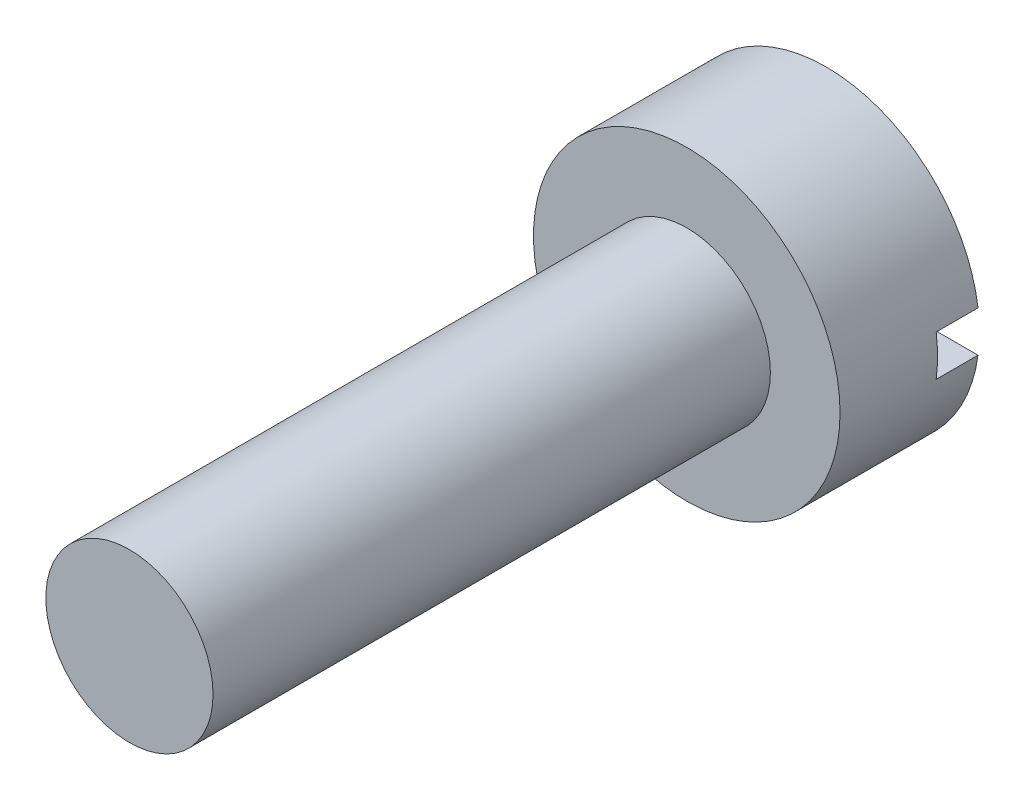
ISO-10303-21;
HEADER;
FILE_DESCRIPTION(('STEP AP214'),'2;1');
FILE_NAME('part.step','',(''),(''),'','','');
FILE_SCHEMA(('AUTOMOTIVE_DESIGN { 1 0 10303 214 1 1 1 1 }'));
ENDSEC;
DATA;
#1=APPLICATION_CONTEXT('core data for automotive mechanical design processes');
#2=APPLICATION_PROTOCOL_DEFINITION('international standard','automotive_design',2000,#1);
#3=PRODUCT_CONTEXT('',#1,'mechanical');
#4=PRODUCT('Part','Part','',(#3));
#5=PRODUCT_RELATED_PRODUCT_CATEGORY('part','',(#4));
#6=PRODUCT_DEFINITION_FORMATION('','',#4);
#7=PRODUCT_DEFINITION_CONTEXT('part definition',#1,'design');
#8=PRODUCT_DEFINITION('design','',#6,#7);
#9=PRODUCT_DEFINITION_SHAPE('','',#8);
#10=(LENGTH_UNIT() NAMED_UNIT(*) SI_UNIT(.MILLI.,.METRE.));
#11=(NAMED_UNIT(*) PLANE_ANGLE_UNIT() SI_UNIT($,.RADIAN.));
#12=(NAMED_UNIT(*) SI_UNIT($,.STERADIAN.) SOLID_ANGLE_UNIT());
#13=UNCERTAINTY_MEASURE_WITH_UNIT(LENGTH_MEASURE(1.E-05),#10,'distance_accuracy_value','');
#14=(GEOMETRIC_REPRESENTATION_CONTEXT(3) GLOBAL_UNCERTAINTY_ASSIGNED_CONTEXT((#13)) GLOBAL_UNIT_ASSIGNED_CONTEXT((#10,
#11,#12)) REPRESENTATION_CONTEXT('',''));
#15=CARTESIAN_POINT('',(0.,0.,0.));
#16=DIRECTION('',(0.,0.,1.));
#17=DIRECTION('',(1.,0.,0.));
#18=AXIS2_PLACEMENT_3D('',#15,#16,#17);
#19=CARTESIAN_POINT('',(0.,0.,0.));
#20=DIRECTION('',(0.,0.,1.));
#21=DIRECTION('',(1.,0.,0.));
#22=AXIS2_PLACEMENT_3D('',#19,#20,#21);
#23=PLANE('',#22);
#24=CARTESIAN_POINT('',(0.,0.,0.));
#25=DIRECTION('',(0.,0.,1.));
#26=DIRECTION('',(1.,0.,0.));
#27=AXIS2_PLACEMENT_3D('',#24,#25,#26);
#28=CIRCLE('',#27,2.75);
#29=CARTESIAN_POINT('',(-2.72533109306739,-0.367519296309898,0.));
#30=VERTEX_POINT('',#29);
#31=CARTESIAN_POINT('',(2.72533109306739,-0.367519296309898,0.));
#32=VERTEX_POINT('',#31);
#33=EDGE_CURVE('E91',#30,#32,#28,.T.);
#34=ORIENTED_EDGE('',*,*,#33,.F.);
#35=DIRECTION('',(1.,0.,0.));
#36=VECTOR('',#35,1.);
#37=CARTESIAN_POINT('',(0.,-0.367519296309898,0.));
#38=LINE('',#37,#36);
#39=EDGE_CURVE('E80',#30,#32,#38,.T.);
#40=ORIENTED_EDGE('',*,*,#39,.T.);
#41=EDGE_LOOP('',(#34,#40));
#42=FACE_BOUND('',#41,.T.);
#43=ADVANCED_FACE('F32',(#42),#23,.F.);
#44=CARTESIAN_POINT('',(0.,0.,2.5));
#45=DIRECTION('',(0.,0.,-1.));
#46=DIRECTION('',(-1.,0.,0.));
#47=AXIS2_PLACEMENT_3D('',#44,#45,#46);
#48=CYLINDRICAL_SURFACE('',#47,2.75);
#49=CARTESIAN_POINT('',(0.,0.,0.75));
#50=DIRECTION('',(0.,0.,1.));
#51=DIRECTION('',(1.,0.,0.));
#52=AXIS2_PLACEMENT_3D('',#49,#50,#51);
#53=CIRCLE('',#52,2.75);
#54=CARTESIAN_POINT('',(-2.72533109306739,0.367519296309898,0.75));
#55=VERTEX_POINT('',#54);
#56=CARTESIAN_POINT('',(-2.72533109306739,-0.367519296309898,0.75));
#57=VERTEX_POINT('',#56);
#58=EDGE_CURVE('E11',#55,#57,#53,.T.);
#59=ORIENTED_EDGE('',*,*,#58,.T.);
#60=DIRECTION('',(0.,0.,-1.));
#61=VECTOR('',#60,1.);
#62=CARTESIAN_POINT('',(-2.72533109306739,-0.367519296309898,2.5));
#63=LINE('',#62,#61);
#64=EDGE_CURVE('E55',#57,#30,#63,.T.);
#65=ORIENTED_EDGE('',*,*,#64,.T.);
#66=ORIENTED_EDGE('',*,*,#33,.T.);
#67=DIRECTION('',(0.,0.,-1.));
#68=VECTOR('',#67,1.);
#69=CARTESIAN_POINT('',(2.72533109306739,-0.367519296309898,2.5));
#70=LINE('',#69,#68);
#71=CARTESIAN_POINT('',(2.72533109306739,-0.367519296309898,0.75));
#72=VERTEX_POINT('',#71);
#73=EDGE_CURVE('E88',#32,#72,#70,.F.);
#74=ORIENTED_EDGE('',*,*,#73,.T.);
#75=CARTESIAN_POINT('',(2.72533109306739,0.367519296309898,0.75));
#76=VERTEX_POINT('',#75);
#77=EDGE_CURVE('E36',#72,#76,#53,.T.);
#78=ORIENTED_EDGE('',*,*,#77,.T.);
#79=DIRECTION('',(0.,0.,-1.));
#80=VECTOR('',#79,1.);
#81=CARTESIAN_POINT('',(2.72533109306739,0.367519296309898,2.5));
#82=LINE('',#81,#80);
#83=CARTESIAN_POINT('',(2.72533109306739,0.367519296309898,0.));
#84=VERTEX_POINT('',#83);
#85=EDGE_CURVE('E75',#76,#84,#82,.T.);
#86=ORIENTED_EDGE('',*,*,#85,.T.);
#87=CARTESIAN_POINT('',(-2.72533109306739,0.367519296309898,0.));
#88=VERTEX_POINT('',#87);
#89=EDGE_CURVE('E86',#84,#88,#28,.T.);
#90=ORIENTED_EDGE('',*,*,#89,.T.);
#91=DIRECTION('',(0.,0.,-1.));
#92=VECTOR('',#91,1.);
#93=CARTESIAN_POINT('',(-2.72533109306739,0.367519296309898,2.5));
#94=LINE('',#93,#92);
#95=EDGE_CURVE('E47',#88,#55,#94,.F.);
#96=ORIENTED_EDGE('',*,*,#95,.T.);
#97=EDGE_LOOP('',(#59,#65,#66,#74,#78,#86,#90,#96));
#98=FACE_BOUND('',#97,.T.);
#99=CARTESIAN_POINT('',(0.,0.,2.5));
#100=DIRECTION('',(0.,0.,1.));
#101=DIRECTION('',(1.,0.,0.));
#102=AXIS2_PLACEMENT_3D('',#99,#100,#101);
#103=CIRCLE('',#102,2.75);
#104=CARTESIAN_POINT('',(2.75,0.,2.5));
#105=VERTEX_POINT('',#104);
#106=EDGE_CURVE('E81',#105,#105,#103,.T.);
#107=ORIENTED_EDGE('',*,*,#106,.F.);
#108=EDGE_LOOP('',(#107));
#109=FACE_BOUND('',#108,.T.);
#110=ADVANCED_FACE('F34',(#98,#109),#48,.T.);
#111=CARTESIAN_POINT('',(0.,0.,2.5));
#112=DIRECTION('',(0.,0.,1.));
#113=DIRECTION('',(1.,0.,0.));
#114=AXIS2_PLACEMENT_3D('',#111,#112,#113);
#115=PLANE('',#114);
#116=CARTESIAN_POINT('',(0.,0.,2.5));
#117=DIRECTION('',(0.,0.,1.));
#118=DIRECTION('',(1.,0.,0.));
#119=AXIS2_PLACEMENT_3D('',#116,#117,#118);
#120=CIRCLE('',#119,1.5);
#121=CARTESIAN_POINT('',(1.5,0.,2.5));
#122=VERTEX_POINT('',#121);
#123=EDGE_CURVE('E101',#122,#122,#120,.T.);
#124=ORIENTED_EDGE('',*,*,#123,.F.);
#125=EDGE_LOOP('',(#124));
#126=FACE_BOUND('',#125,.T.);
#127=ORIENTED_EDGE('',*,*,#106,.T.);
#128=EDGE_LOOP('',(#127));
#129=FACE_BOUND('',#128,.T.);
#130=ADVANCED_FACE('F117',(#126,#129),#115,.T.);
#131=ORIENTED_EDGE('',*,*,#89,.F.);
#132=DIRECTION('',(-1.,0.,0.));
#133=VECTOR('',#132,1.);
#134=CARTESIAN_POINT('',(0.,0.367519296309898,0.));
#135=LINE('',#134,#133);
#136=EDGE_CURVE('E72',#84,#88,#135,.T.);
#137=ORIENTED_EDGE('',*,*,#136,.T.);
#138=EDGE_LOOP('',(#131,#137));
#139=FACE_BOUND('',#138,.T.);
#140=ADVANCED_FACE('F90',(#139),#23,.F.);
#141=CARTESIAN_POINT('',(0.,0.,12.5));
#142=DIRECTION('',(0.,0.,-1.));
#143=DIRECTION('',(-1.,0.,0.));
#144=AXIS2_PLACEMENT_3D('',#141,#142,#143);
#145=CYLINDRICAL_SURFACE('',#144,1.5);
#146=CARTESIAN_POINT('',(0.,0.,12.5));
#147=DIRECTION('',(0.,0.,1.));
#148=DIRECTION('',(1.,0.,0.));
#149=AXIS2_PLACEMENT_3D('',#146,#147,#148);
#150=CIRCLE('',#149,1.5);
#151=CARTESIAN_POINT('',(1.5,0.,12.5));
#152=VERTEX_POINT('',#151);
#153=EDGE_CURVE('E96',#152,#152,#150,.T.);
#154=ORIENTED_EDGE('',*,*,#153,.F.);
#155=EDGE_LOOP('',(#154));
#156=FACE_BOUND('',#155,.T.);
#157=ORIENTED_EDGE('',*,*,#123,.T.);
#158=EDGE_LOOP('',(#157));
#159=FACE_BOUND('',#158,.T.);
#160=ADVANCED_FACE('F111',(#156,#159),#145,.T.);
#161=CARTESIAN_POINT('',(0.,0.,12.5));
#162=DIRECTION('',(0.,0.,1.));
#163=DIRECTION('',(1.,0.,0.));
#164=AXIS2_PLACEMENT_3D('',#161,#162,#163);
#165=PLANE('',#164);
#166=ORIENTED_EDGE('',*,*,#153,.T.);
#167=EDGE_LOOP('',(#166));
#168=FACE_BOUND('',#167,.T.);
#169=ADVANCED_FACE('F109',(#168),#165,.T.);
#170=CARTESIAN_POINT('',(0.,0.,0.75));
#171=DIRECTION('',(0.,0.,1.));
#172=DIRECTION('',(1.,0.,0.));
#173=AXIS2_PLACEMENT_3D('',#170,#171,#172);
#174=PLANE('',#173);
#175=DIRECTION('',(1.,0.,0.));
#176=VECTOR('',#175,1.);
#177=CARTESIAN_POINT('',(3.69334206415088,0.367519296309898,0.75));
#178=LINE('',#177,#176);
#179=EDGE_CURVE('E191',#55,#76,#178,.T.);
#180=ORIENTED_EDGE('',*,*,#179,.T.);
#181=ORIENTED_EDGE('',*,*,#77,.F.);
#182=DIRECTION('',(-1.,0.,0.));
#183=VECTOR('',#182,1.);
#184=CARTESIAN_POINT('',(3.69334206415088,-0.367519296309898,0.75));
#185=LINE('',#184,#183);
#186=EDGE_CURVE('E190',#72,#57,#185,.T.);
#187=ORIENTED_EDGE('',*,*,#186,.T.);
#188=ORIENTED_EDGE('',*,*,#58,.F.);
#189=EDGE_LOOP('',(#180,#181,#187,#188));
#190=FACE_BOUND('',#189,.T.);
#191=ADVANCED_FACE('F135',(#190),#174,.F.);
#192=CARTESIAN_POINT('',(3.69334206415088,-0.367519296309898,0.75));
#193=DIRECTION('',(0.,-1.,0.));
#194=DIRECTION('',(0.,0.,-1.));
#195=AXIS2_PLACEMENT_3D('',#192,#193,#194);
#196=PLANE('',#195);
#197=ORIENTED_EDGE('',*,*,#186,.F.);
#198=ORIENTED_EDGE('',*,*,#73,.F.);
#199=ORIENTED_EDGE('',*,*,#39,.F.);
#200=ORIENTED_EDGE('',*,*,#64,.F.);
#201=EDGE_LOOP('',(#197,#198,#199,#200));
#202=FACE_BOUND('',#201,.T.);
#203=ADVANCED_FACE('F140',(#202),#196,.F.);
#204=CARTESIAN_POINT('',(3.69334206415088,0.367519296309898,0.75));
#205=DIRECTION('',(0.,1.,0.));
#206=DIRECTION('',(0.,0.,1.));
#207=AXIS2_PLACEMENT_3D('',#204,#205,#206);
#208=PLANE('',#207);
#209=ORIENTED_EDGE('',*,*,#179,.F.);
#210=ORIENTED_EDGE('',*,*,#95,.F.);
#211=ORIENTED_EDGE('',*,*,#136,.F.);
#212=ORIENTED_EDGE('',*,*,#85,.F.);
#213=EDGE_LOOP('',(#209,#210,#211,#212));
#214=FACE_BOUND('',#213,.T.);
#215=ADVANCED_FACE('F74',(#214),#208,.F.);
#216=CLOSED_SHELL('',(#43,#110,#130,#140,#160,#169,#191,#203,#215));
#217=MANIFOLD_SOLID_BREP('B2',#216);
#218=ADVANCED_BREP_SHAPE_REPRESENTATION('',(#18,#217),#14);
#219=SHAPE_DEFINITION_REPRESENTATION(#9,#218);
ENDSEC;
END-ISO-10303-21;
